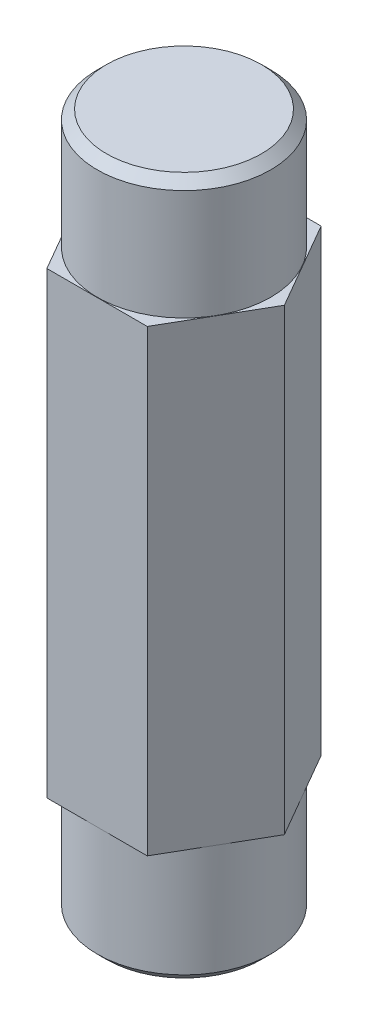
ISO-10303-21;
HEADER;
FILE_DESCRIPTION(('STEP AP214'),'2;1');
FILE_NAME('part.step','',(''),(''),'','','');
FILE_SCHEMA(('AUTOMOTIVE_DESIGN { 1 0 10303 214 1 1 1 1 }'));
ENDSEC;
DATA;
#1=APPLICATION_CONTEXT('core data for automotive mechanical design processes');
#2=APPLICATION_PROTOCOL_DEFINITION('international standard','automotive_design',2000,#1);
#3=PRODUCT_CONTEXT('',#1,'mechanical');
#4=PRODUCT('Part','Part','',(#3));
#5=PRODUCT_RELATED_PRODUCT_CATEGORY('part','',(#4));
#6=PRODUCT_DEFINITION_FORMATION('','',#4);
#7=PRODUCT_DEFINITION_CONTEXT('part definition',#1,'design');
#8=PRODUCT_DEFINITION('design','',#6,#7);
#9=PRODUCT_DEFINITION_SHAPE('','',#8);
#10=(LENGTH_UNIT() NAMED_UNIT(*) SI_UNIT(.MILLI.,.METRE.));
#11=(NAMED_UNIT(*) PLANE_ANGLE_UNIT() SI_UNIT($,.RADIAN.));
#12=(NAMED_UNIT(*) SI_UNIT($,.STERADIAN.) SOLID_ANGLE_UNIT());
#13=UNCERTAINTY_MEASURE_WITH_UNIT(LENGTH_MEASURE(1.E-05),#10,'distance_accuracy_value','');
#14=(GEOMETRIC_REPRESENTATION_CONTEXT(3) GLOBAL_UNCERTAINTY_ASSIGNED_CONTEXT((#13)) GLOBAL_UNIT_ASSIGNED_CONTEXT((#10,
#11,#12)) REPRESENTATION_CONTEXT('',''));
#15=CARTESIAN_POINT('',(0.,0.,0.));
#16=DIRECTION('',(0.,0.,1.));
#17=DIRECTION('',(1.,0.,0.));
#18=AXIS2_PLACEMENT_3D('',#15,#16,#17);
#19=CARTESIAN_POINT('',(-39.2241243202129,6.34999999999991,-16.6661167863662));
#20=DIRECTION('',(0.,-1.,0.));
#21=DIRECTION('',(1.,0.,0.));
#22=AXIS2_PLACEMENT_3D('',#19,#20,#21);
#23=PLANE('',#22);
#24=CARTESIAN_POINT('',(-39.2241243202128,6.34999999994079,-16.6661167863668));
#25=DIRECTION('',(0.,-1.,0.));
#26=DIRECTION('',(0.,0.,-1.));
#27=AXIS2_PLACEMENT_3D('',#24,#25,#26);
#28=CIRCLE('',#27,4.24180000000379);
#29=CARTESIAN_POINT('',(-39.2241243202128,6.34999999994079,-20.9079167863706));
#30=VERTEX_POINT('',#29);
#31=EDGE_CURVE('E17',#30,#30,#28,.T.);
#32=ORIENTED_EDGE('',*,*,#31,.F.);
#33=EDGE_LOOP('',(#32));
#34=FACE_BOUND('',#33,.T.);
#35=ADVANCED_FACE('F14',(#34),#23,.F.);
#36=CARTESIAN_POINT('',(-39.2241243202129,-31.8769999999992,-16.6661167863662));
#37=DIRECTION('',(0.,1.,0.));
#38=DIRECTION('',(-1.,0.,0.));
#39=AXIS2_PLACEMENT_3D('',#36,#37,#38);
#40=PLANE('',#39);
#41=CARTESIAN_POINT('',(-39.2241243202136,-31.8770000000086,-16.6661167863666));
#42=DIRECTION('',(0.,1.,0.));
#43=DIRECTION('',(0.,0.,1.));
#44=AXIS2_PLACEMENT_3D('',#41,#42,#43);
#45=CIRCLE('',#44,4.24180000002966);
#46=CARTESIAN_POINT('',(-39.2241243202136,-31.8770000000086,-12.4243167863369));
#47=VERTEX_POINT('',#46);
#48=EDGE_CURVE('E106',#47,#47,#45,.T.);
#49=ORIENTED_EDGE('',*,*,#48,.F.);
#50=EDGE_LOOP('',(#49));
#51=FACE_BOUND('',#50,.T.);
#52=ADVANCED_FACE('F120',(#51),#40,.F.);
#53=CARTESIAN_POINT('',(-39.2241243202128,5.8420000000865,-16.6661167863668));
#54=DIRECTION('',(0.,-1.,0.));
#55=DIRECTION('',(0.,0.,-1.));
#56=AXIS2_PLACEMENT_3D('',#53,#54,#55);
#57=CONICAL_SURFACE('',#56,4.74979999991493,0.785398163453397);
#58=CARTESIAN_POINT('',(-39.2241243202129,5.84199999999996,-16.6661167863662));
#59=DIRECTION('',(0.,-1.,0.));
#60=DIRECTION('',(1.,0.,0.));
#61=AXIS2_PLACEMENT_3D('',#58,#59,#60);
#62=CIRCLE('',#61,4.74980000000004);
#63=CARTESIAN_POINT('',(-34.4743243202128,5.84199999999996,-16.6661167863662));
#64=VERTEX_POINT('',#63);
#65=EDGE_CURVE('E103',#64,#64,#62,.T.);
#66=ORIENTED_EDGE('',*,*,#65,.F.);
#67=EDGE_LOOP('',(#66));
#68=FACE_BOUND('',#67,.T.);
#69=ORIENTED_EDGE('',*,*,#31,.T.);
#70=EDGE_LOOP('',(#69));
#71=FACE_BOUND('',#70,.T.);
#72=ADVANCED_FACE('F117',(#68,#71),#57,.T.);
#73=CARTESIAN_POINT('',(-39.2241243202136,-31.3690000000406,-16.6661167863666));
#74=DIRECTION('',(0.,1.,0.));
#75=DIRECTION('',(0.,0.,1.));
#76=AXIS2_PLACEMENT_3D('',#73,#74,#75);
#77=CONICAL_SURFACE('',#76,4.74980000005448,0.785398163453397);
#78=CARTESIAN_POINT('',(-39.2241243202129,-31.3689999999992,-16.6661167863662));
#79=DIRECTION('',(0.,1.,0.));
#80=DIRECTION('',(-1.,0.,0.));
#81=AXIS2_PLACEMENT_3D('',#78,#79,#80);
#82=CIRCLE('',#81,4.74980000000004);
#83=CARTESIAN_POINT('',(-43.9739243202129,-31.3689999999992,-16.6661167863662));
#84=VERTEX_POINT('',#83);
#85=EDGE_CURVE('E100',#84,#84,#82,.T.);
#86=ORIENTED_EDGE('',*,*,#85,.F.);
#87=EDGE_LOOP('',(#86));
#88=FACE_BOUND('',#87,.T.);
#89=ORIENTED_EDGE('',*,*,#48,.T.);
#90=EDGE_LOOP('',(#89));
#91=FACE_BOUND('',#90,.T.);
#92=ADVANCED_FACE('F163',(#88,#91),#77,.T.);
#93=CARTESIAN_POINT('',(-39.2241243202129,6.34999999999991,-16.6661167863662));
#94=DIRECTION('',(0.,-1.,0.));
#95=DIRECTION('',(1.,0.,0.));
#96=AXIS2_PLACEMENT_3D('',#93,#94,#95);
#97=CYLINDRICAL_SURFACE('',#96,4.74980000000004);
#98=CARTESIAN_POINT('',(-39.2241243202129,-0.203199999999237,-16.6661167863662));
#99=DIRECTION('',(0.,-1.,0.));
#100=DIRECTION('',(1.,0.,0.));
#101=AXIS2_PLACEMENT_3D('',#98,#99,#100);
#102=CIRCLE('',#101,4.74980000000004);
#103=CARTESIAN_POINT('',(-34.4743243202128,-0.203199999999237,-16.6661167863662));
#104=VERTEX_POINT('',#103);
#105=EDGE_CURVE('E77',#104,#104,#102,.T.);
#106=ORIENTED_EDGE('',*,*,#105,.F.);
#107=EDGE_LOOP('',(#106));
#108=FACE_BOUND('',#107,.T.);
#109=ORIENTED_EDGE('',*,*,#65,.T.);
#110=EDGE_LOOP('',(#109));
#111=FACE_BOUND('',#110,.T.);
#112=ADVANCED_FACE('F159',(#108,#111),#97,.T.);
#113=CARTESIAN_POINT('',(-39.2241243202129,-31.8769999999992,-16.6661167863662));
#114=DIRECTION('',(0.,1.,0.));
#115=DIRECTION('',(-1.,0.,0.));
#116=AXIS2_PLACEMENT_3D('',#113,#114,#115);
#117=CYLINDRICAL_SURFACE('',#116,4.74980000000004);
#118=CARTESIAN_POINT('',(-39.2241243202129,-25.3237999999992,-16.6661167863662));
#119=DIRECTION('',(0.,1.,0.));
#120=DIRECTION('',(-1.,0.,0.));
#121=AXIS2_PLACEMENT_3D('',#118,#119,#120);
#122=CIRCLE('',#121,4.74980000000004);
#123=CARTESIAN_POINT('',(-43.9739243202129,-25.3237999999992,-16.6661167863662));
#124=VERTEX_POINT('',#123);
#125=EDGE_CURVE('E107',#124,#124,#122,.T.);
#126=ORIENTED_EDGE('',*,*,#125,.F.);
#127=EDGE_LOOP('',(#126));
#128=FACE_BOUND('',#127,.T.);
#129=ORIENTED_EDGE('',*,*,#85,.T.);
#130=EDGE_LOOP('',(#129));
#131=FACE_BOUND('',#130,.T.);
#132=ADVANCED_FACE('F155',(#128,#131),#117,.T.);
#133=CARTESIAN_POINT('',(-41.9737549772282,-25.5269999999992,-11.9036167863662));
#134=DIRECTION('',(0.,0.,1.));
#135=DIRECTION('',(1.,0.,0.));
#136=AXIS2_PLACEMENT_3D('',#133,#134,#135);
#137=PLANE('',#136);
#138=DIRECTION('',(0.,1.,0.));
#139=VECTOR('',#138,1.);
#140=CARTESIAN_POINT('',(-41.9737549772278,-25.5269999999992,-11.9036167863665));
#141=LINE('',#140,#139);
#142=CARTESIAN_POINT('',(-41.9737549772279,-25.3237999999992,-11.9036167863661));
#143=VERTEX_POINT('',#142);
#144=CARTESIAN_POINT('',(-41.9737549772279,-0.203199999999217,-11.9036167863664));
#145=VERTEX_POINT('',#144);
#146=EDGE_CURVE('E64',#143,#145,#141,.T.);
#147=ORIENTED_EDGE('',*,*,#146,.F.);
#148=DIRECTION('',(1.,0.,0.));
#149=VECTOR('',#148,1.);
#150=CARTESIAN_POINT('',(-41.9737549772282,-25.3237999999992,-11.9036167863657));
#151=LINE('',#150,#149);
#152=CARTESIAN_POINT('',(-36.4744936631966,-25.3237999999992,-11.9036167863659));
#153=VERTEX_POINT('',#152);
#154=EDGE_CURVE('E109',#153,#143,#151,.F.);
#155=ORIENTED_EDGE('',*,*,#154,.F.);
#156=DIRECTION('',(0.,1.,0.));
#157=VECTOR('',#156,1.);
#158=CARTESIAN_POINT('',(-36.4744936631964,-25.5269999999992,-11.9036167863657));
#159=LINE('',#158,#157);
#160=CARTESIAN_POINT('',(-36.4744936631965,-0.203199999999223,-11.9036167863661));
#161=VERTEX_POINT('',#160);
#162=EDGE_CURVE('E78',#161,#153,#159,.F.);
#163=ORIENTED_EDGE('',*,*,#162,.F.);
#164=DIRECTION('',(-1.,0.,0.));
#165=VECTOR('',#164,1.);
#166=CARTESIAN_POINT('',(-44.7233856342429,-0.203199999999182,-11.9036167863664));
#167=LINE('',#166,#165);
#168=EDGE_CURVE('E85',#145,#161,#167,.F.);
#169=ORIENTED_EDGE('',*,*,#168,.F.);
#170=EDGE_LOOP('',(#147,#155,#163,#169));
#171=FACE_BOUND('',#170,.T.);
#172=ADVANCED_FACE('F152',(#171),#137,.T.);
#173=CARTESIAN_POINT('',(-44.7233856342431,-25.5269999999992,-16.6661167863659));
#174=DIRECTION('',(-0.866025403784435,0.,0.500000000000007));
#175=DIRECTION('',(0.500000000000007,0.,0.866025403784435));
#176=AXIS2_PLACEMENT_3D('',#173,#174,#175);
#177=PLANE('',#176);
#178=DIRECTION('',(0.,1.,0.));
#179=VECTOR('',#178,1.);
#180=CARTESIAN_POINT('',(-44.7233856342434,-25.5269999999992,-16.6661167863668));
#181=LINE('',#180,#179);
#182=CARTESIAN_POINT('',(-44.7233856342433,-25.3237999999992,-16.6661167863665));
#183=VERTEX_POINT('',#182);
#184=CARTESIAN_POINT('',(-44.7233856342433,-0.20319999999919,-16.6661167863667));
#185=VERTEX_POINT('',#184);
#186=EDGE_CURVE('E69',#183,#185,#181,.T.);
#187=ORIENTED_EDGE('',*,*,#186,.F.);
#188=DIRECTION('',(-0.499999999999844,0.,-0.866025403784528));
#189=VECTOR('',#188,1.);
#190=CARTESIAN_POINT('',(-41.9737549772282,-25.3237999999992,-11.9036167863662));
#191=LINE('',#190,#189);
#192=EDGE_CURVE('E267',#143,#183,#191,.T.);
#193=ORIENTED_EDGE('',*,*,#192,.F.);
#194=ORIENTED_EDGE('',*,*,#146,.T.);
#195=DIRECTION('',(0.499999999999892,0.,0.866025403784501));
#196=VECTOR('',#195,1.);
#197=CARTESIAN_POINT('',(-44.7233856342429,-0.203199999999182,-16.6661167863667));
#198=LINE('',#197,#196);
#199=EDGE_CURVE('E81',#185,#145,#198,.T.);
#200=ORIENTED_EDGE('',*,*,#199,.F.);
#201=EDGE_LOOP('',(#187,#193,#194,#200));
#202=FACE_BOUND('',#201,.T.);
#203=ADVANCED_FACE('F82',(#202),#177,.T.);
#204=CARTESIAN_POINT('',(-36.4744936631964,-25.5269999999992,-11.9036167863657));
#205=DIRECTION('',(0.866025403784434,0.,0.500000000000007));
#206=DIRECTION('',(0.500000000000007,0.,-0.866025403784434));
#207=AXIS2_PLACEMENT_3D('',#204,#205,#206);
#208=PLANE('',#207);
#209=ORIENTED_EDGE('',*,*,#162,.T.);
#210=DIRECTION('',(-0.499999999999796,0.,0.866025403784556));
#211=VECTOR('',#210,1.);
#212=CARTESIAN_POINT('',(-33.724863006182,-25.3237999999992,-16.6661167863665));
#213=LINE('',#212,#211);
#214=CARTESIAN_POINT('',(-33.7248630061817,-25.3237999999992,-16.6661167863663));
#215=VERTEX_POINT('',#214);
#216=EDGE_CURVE('E271',#215,#153,#213,.T.);
#217=ORIENTED_EDGE('',*,*,#216,.F.);
#218=DIRECTION('',(0.,1.,0.));
#219=VECTOR('',#218,1.);
#220=CARTESIAN_POINT('',(-33.7248630061821,-25.5269999999992,-16.6661167863664));
#221=LINE('',#220,#219);
#222=CARTESIAN_POINT('',(-33.7248630061815,-0.20319999999921,-16.6661167863664));
#223=VERTEX_POINT('',#222);
#224=EDGE_CURVE('E110',#223,#215,#221,.F.);
#225=ORIENTED_EDGE('',*,*,#224,.F.);
#226=DIRECTION('',(0.499999999999844,0.,-0.866025403784529));
#227=VECTOR('',#226,1.);
#228=CARTESIAN_POINT('',(-36.4744936631966,-0.203199999999182,-11.9036167863658));
#229=LINE('',#228,#227);
#230=EDGE_CURVE('E279',#161,#223,#229,.T.);
#231=ORIENTED_EDGE('',*,*,#230,.F.);
#232=EDGE_LOOP('',(#209,#217,#225,#231));
#233=FACE_BOUND('',#232,.T.);
#234=ADVANCED_FACE('F146',(#233),#208,.T.);
#235=CARTESIAN_POINT('',(-41.9737549772279,-25.5269999999992,-21.4286167863665));
#236=DIRECTION('',(-0.866025403784434,0.,-0.500000000000008));
#237=DIRECTION('',(-0.500000000000008,0.,0.866025403784434));
#238=AXIS2_PLACEMENT_3D('',#235,#236,#237);
#239=PLANE('',#238);
#240=DIRECTION('',(0.,1.,0.));
#241=VECTOR('',#240,1.);
#242=CARTESIAN_POINT('',(-41.9737549772279,-25.5269999999992,-21.428616786366));
#243=LINE('',#242,#241);
#244=CARTESIAN_POINT('',(-41.9737549772279,-25.3237999999992,-21.4286167863664));
#245=VERTEX_POINT('',#244);
#246=CARTESIAN_POINT('',(-41.9737549772279,-0.203199999999196,-21.4286167863664));
#247=VERTEX_POINT('',#246);
#248=EDGE_CURVE('E283',#245,#247,#243,.T.);
#249=ORIENTED_EDGE('',*,*,#248,.F.);
#250=DIRECTION('',(0.499999999999907,0.,-0.866025403784492));
#251=VECTOR('',#250,1.);
#252=CARTESIAN_POINT('',(-44.7233856342428,-25.3237999999992,-16.6661167863665));
#253=LINE('',#252,#251);
#254=EDGE_CURVE('E75',#183,#245,#253,.T.);
#255=ORIENTED_EDGE('',*,*,#254,.F.);
#256=ORIENTED_EDGE('',*,*,#186,.T.);
#257=DIRECTION('',(-0.499999999999923,0.,0.866025403784483));
#258=VECTOR('',#257,1.);
#259=CARTESIAN_POINT('',(-41.9737549772279,-0.203199999999182,-21.4286167863666));
#260=LINE('',#259,#258);
#261=EDGE_CURVE('E72',#247,#185,#260,.T.);
#262=ORIENTED_EDGE('',*,*,#261,.F.);
#263=EDGE_LOOP('',(#249,#255,#256,#262));
#264=FACE_BOUND('',#263,.T.);
#265=ADVANCED_FACE('F70',(#264),#239,.T.);
#266=CARTESIAN_POINT('',(-44.7233856342429,-0.203199999999182,-16.6661167863667));
#267=DIRECTION('',(0.,1.,0.));
#268=DIRECTION('',(-1.,0.,0.));
#269=AXIS2_PLACEMENT_3D('',#266,#267,#268);
#270=PLANE('',#269);
#271=DIRECTION('',(-0.500000000000007,0.,-0.866025403784435));
#272=VECTOR('',#271,1.);
#273=CARTESIAN_POINT('',(-33.724863006182,-0.203199999999237,-16.6661167863664));
#274=LINE('',#273,#272);
#275=CARTESIAN_POINT('',(-36.474493663196,-0.20319999999921,-21.4286167863661));
#276=VERTEX_POINT('',#275);
#277=EDGE_CURVE('E276',#276,#223,#274,.F.);
#278=ORIENTED_EDGE('',*,*,#277,.F.);
#279=DIRECTION('',(-1.,0.,0.));
#280=VECTOR('',#279,1.);
#281=CARTESIAN_POINT('',(-36.4744936631962,-0.203199999999237,-21.428616786366));
#282=LINE('',#281,#280);
#283=EDGE_CURVE('E90',#247,#276,#282,.F.);
#284=ORIENTED_EDGE('',*,*,#283,.F.);
#285=ORIENTED_EDGE('',*,*,#261,.T.);
#286=ORIENTED_EDGE('',*,*,#199,.T.);
#287=ORIENTED_EDGE('',*,*,#168,.T.);
#288=ORIENTED_EDGE('',*,*,#230,.T.);
#289=EDGE_LOOP('',(#278,#284,#285,#286,#287,#288));
#290=FACE_BOUND('',#289,.T.);
#291=ORIENTED_EDGE('',*,*,#105,.T.);
#292=EDGE_LOOP('',(#291));
#293=FACE_BOUND('',#292,.T.);
#294=ADVANCED_FACE('F87',(#290,#293),#270,.T.);
#295=CARTESIAN_POINT('',(-33.724863006182,-25.5269999999992,-16.6661167863664));
#296=DIRECTION('',(0.866025403784435,0.,-0.500000000000007));
#297=DIRECTION('',(-0.500000000000007,0.,-0.866025403784435));
#298=AXIS2_PLACEMENT_3D('',#295,#296,#297);
#299=PLANE('',#298);
#300=ORIENTED_EDGE('',*,*,#224,.T.);
#301=DIRECTION('',(0.499999999999843,0.,0.86602540378453));
#302=VECTOR('',#301,1.);
#303=CARTESIAN_POINT('',(-36.4744936631962,-25.3237999999992,-21.428616786366));
#304=LINE('',#303,#302);
#305=CARTESIAN_POINT('',(-36.4744936631966,-25.3237999999992,-21.4286167863659));
#306=VERTEX_POINT('',#305);
#307=EDGE_CURVE('E32',#306,#215,#304,.T.);
#308=ORIENTED_EDGE('',*,*,#307,.F.);
#309=DIRECTION('',(0.,1.,0.));
#310=VECTOR('',#309,1.);
#311=CARTESIAN_POINT('',(-36.4744936631956,-25.5269999999992,-21.428616786366));
#312=LINE('',#311,#310);
#313=EDGE_CURVE('E23',#276,#306,#312,.F.);
#314=ORIENTED_EDGE('',*,*,#313,.F.);
#315=ORIENTED_EDGE('',*,*,#277,.T.);
#316=EDGE_LOOP('',(#300,#308,#314,#315));
#317=FACE_BOUND('',#316,.T.);
#318=ADVANCED_FACE('F135',(#317),#299,.T.);
#319=CARTESIAN_POINT('',(-41.9737549772282,-25.3237999999992,-11.9036167863662));
#320=DIRECTION('',(0.,-1.,0.));
#321=DIRECTION('',(1.,0.,0.));
#322=AXIS2_PLACEMENT_3D('',#319,#320,#321);
#323=PLANE('',#322);
#324=ORIENTED_EDGE('',*,*,#307,.T.);
#325=ORIENTED_EDGE('',*,*,#216,.T.);
#326=ORIENTED_EDGE('',*,*,#154,.T.);
#327=ORIENTED_EDGE('',*,*,#192,.T.);
#328=ORIENTED_EDGE('',*,*,#254,.T.);
#329=DIRECTION('',(-1.,0.,0.));
#330=VECTOR('',#329,1.);
#331=CARTESIAN_POINT('',(-36.4744936631962,-25.3237999999992,-21.428616786366));
#332=LINE('',#331,#330);
#333=EDGE_CURVE('E9',#306,#245,#332,.T.);
#334=ORIENTED_EDGE('',*,*,#333,.F.);
#335=EDGE_LOOP('',(#324,#325,#326,#327,#328,#334));
#336=FACE_BOUND('',#335,.T.);
#337=ORIENTED_EDGE('',*,*,#125,.T.);
#338=EDGE_LOOP('',(#337));
#339=FACE_BOUND('',#338,.T.);
#340=ADVANCED_FACE('F128',(#336,#339),#323,.T.);
#341=CARTESIAN_POINT('',(-36.4744936631962,-25.5269999999992,-21.428616786366));
#342=DIRECTION('',(0.,0.,-1.));
#343=DIRECTION('',(-1.,0.,0.));
#344=AXIS2_PLACEMENT_3D('',#341,#342,#343);
#345=PLANE('',#344);
#346=ORIENTED_EDGE('',*,*,#313,.T.);
#347=ORIENTED_EDGE('',*,*,#333,.T.);
#348=ORIENTED_EDGE('',*,*,#248,.T.);
#349=ORIENTED_EDGE('',*,*,#283,.T.);
#350=EDGE_LOOP('',(#346,#347,#348,#349));
#351=FACE_BOUND('',#350,.T.);
#352=ADVANCED_FACE('F126',(#351),#345,.T.);
#353=CLOSED_SHELL('',(#35,#52,#72,#92,#112,#132,#172,#203,#234,#265,#294,#318,#340,#352));
#354=MANIFOLD_SOLID_BREP('B1',#353);
#355=ADVANCED_BREP_SHAPE_REPRESENTATION('',(#18,#354),#14);
#356=SHAPE_DEFINITION_REPRESENTATION(#9,#355);
ENDSEC;
END-ISO-10303-21;
